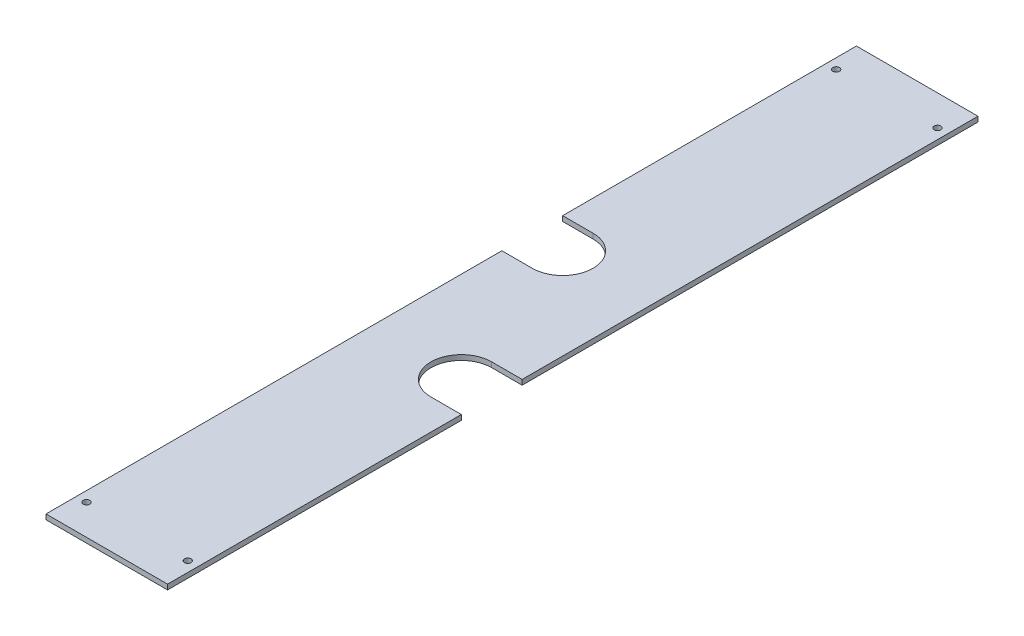
ISO-10303-21;
HEADER;
FILE_DESCRIPTION(('STEP AP214'),'2;1');
FILE_NAME('part.step','',(''),(''),'','','');
FILE_SCHEMA(('AUTOMOTIVE_DESIGN { 1 0 10303 214 1 1 1 1 }'));
ENDSEC;
DATA;
#1=APPLICATION_CONTEXT('core data for automotive mechanical design processes');
#2=APPLICATION_PROTOCOL_DEFINITION('international standard','automotive_design',2000,#1);
#3=PRODUCT_CONTEXT('',#1,'mechanical');
#4=PRODUCT('Part','Part','',(#3));
#5=PRODUCT_RELATED_PRODUCT_CATEGORY('part','',(#4));
#6=PRODUCT_DEFINITION_FORMATION('','',#4);
#7=PRODUCT_DEFINITION_CONTEXT('part definition',#1,'design');
#8=PRODUCT_DEFINITION('design','',#6,#7);
#9=PRODUCT_DEFINITION_SHAPE('','',#8);
#10=(LENGTH_UNIT() NAMED_UNIT(*) SI_UNIT(.MILLI.,.METRE.));
#11=(NAMED_UNIT(*) PLANE_ANGLE_UNIT() SI_UNIT($,.RADIAN.));
#12=(NAMED_UNIT(*) SI_UNIT($,.STERADIAN.) SOLID_ANGLE_UNIT());
#13=UNCERTAINTY_MEASURE_WITH_UNIT(LENGTH_MEASURE(1.E-05),#10,'distance_accuracy_value','');
#14=(GEOMETRIC_REPRESENTATION_CONTEXT(3) GLOBAL_UNCERTAINTY_ASSIGNED_CONTEXT((#13)) GLOBAL_UNIT_ASSIGNED_CONTEXT((#10,
#11,#12)) REPRESENTATION_CONTEXT('',''));
#15=CARTESIAN_POINT('',(0.,0.,0.));
#16=DIRECTION('',(0.,0.,1.));
#17=DIRECTION('',(1.,0.,0.));
#18=AXIS2_PLACEMENT_3D('',#15,#16,#17);
#19=CARTESIAN_POINT('',(-38.1,22.8952505991963,508.));
#20=DIRECTION('',(1.,0.,0.));
#21=DIRECTION('',(0.,0.,-1.));
#22=AXIS2_PLACEMENT_3D('',#19,#20,#21);
#23=PLANE('',#22);
#24=DIRECTION('',(0.,0.,-1.));
#25=VECTOR('',#24,1.);
#26=CARTESIAN_POINT('',(-38.1,22.8952505991963,508.));
#27=LINE('',#26,#25);
#28=CARTESIAN_POINT('',(-38.1,22.8952505991963,508.));
#29=VERTEX_POINT('',#28);
#30=CARTESIAN_POINT('',(-38.1,22.8952505991963,222.25));
#31=VERTEX_POINT('',#30);
#32=EDGE_CURVE('E210',#29,#31,#27,.T.);
#33=ORIENTED_EDGE('',*,*,#32,.T.);
#34=DIRECTION('',(0.,1.,0.));
#35=VECTOR('',#34,1.);
#36=CARTESIAN_POINT('',(-38.1,19.7202505991963,222.25));
#37=LINE('',#36,#35);
#38=CARTESIAN_POINT('',(-38.1,19.7202505991963,222.25));
#39=VERTEX_POINT('',#38);
#40=EDGE_CURVE('E159',#39,#31,#37,.T.);
#41=ORIENTED_EDGE('',*,*,#40,.F.);
#42=DIRECTION('',(0.,0.,-1.));
#43=VECTOR('',#42,1.);
#44=CARTESIAN_POINT('',(-38.1,19.7202505991963,508.));
#45=LINE('',#44,#43);
#46=CARTESIAN_POINT('',(-38.1,19.7202505991963,508.));
#47=VERTEX_POINT('',#46);
#48=EDGE_CURVE('E11',#47,#39,#45,.T.);
#49=ORIENTED_EDGE('',*,*,#48,.F.);
#50=DIRECTION('',(0.,-1.,0.));
#51=VECTOR('',#50,1.);
#52=CARTESIAN_POINT('',(-38.1,22.8952505991963,508.));
#53=LINE('',#52,#51);
#54=EDGE_CURVE('E187',#29,#47,#53,.T.);
#55=ORIENTED_EDGE('',*,*,#54,.F.);
#56=EDGE_LOOP('',(#33,#41,#49,#55));
#57=FACE_BOUND('',#56,.T.);
#58=ADVANCED_FACE('F38',(#57),#23,.F.);
#59=CARTESIAN_POINT('',(38.1,22.8952505991963,508.));
#60=DIRECTION('',(1.,0.,0.));
#61=DIRECTION('',(0.,0.,-1.));
#62=AXIS2_PLACEMENT_3D('',#59,#60,#61);
#63=PLANE('',#62);
#64=DIRECTION('',(0.,1.,0.));
#65=VECTOR('',#64,1.);
#66=CARTESIAN_POINT('',(38.1,19.7202505991963,285.75));
#67=LINE('',#66,#65);
#68=CARTESIAN_POINT('',(38.1,19.7202505991963,285.75));
#69=VERTEX_POINT('',#68);
#70=CARTESIAN_POINT('',(38.1,22.8952505991963,285.75));
#71=VERTEX_POINT('',#70);
#72=EDGE_CURVE('E168',#69,#71,#67,.T.);
#73=ORIENTED_EDGE('',*,*,#72,.F.);
#74=DIRECTION('',(0.,0.,-1.));
#75=VECTOR('',#74,1.);
#76=CARTESIAN_POINT('',(38.1,19.7202505991963,508.));
#77=LINE('',#76,#75);
#78=CARTESIAN_POINT('',(38.1,19.7202505991963,0.));
#79=VERTEX_POINT('',#78);
#80=EDGE_CURVE('E216',#69,#79,#77,.T.);
#81=ORIENTED_EDGE('',*,*,#80,.T.);
#82=DIRECTION('',(0.,-1.,0.));
#83=VECTOR('',#82,1.);
#84=CARTESIAN_POINT('',(38.1,22.8952505991963,0.));
#85=LINE('',#84,#83);
#86=CARTESIAN_POINT('',(38.1,22.8952505991963,0.));
#87=VERTEX_POINT('',#86);
#88=EDGE_CURVE('E205',#87,#79,#85,.T.);
#89=ORIENTED_EDGE('',*,*,#88,.F.);
#90=DIRECTION('',(0.,0.,-1.));
#91=VECTOR('',#90,1.);
#92=CARTESIAN_POINT('',(38.1,22.8952505991963,508.));
#93=LINE('',#92,#91);
#94=EDGE_CURVE('E213',#71,#87,#93,.T.);
#95=ORIENTED_EDGE('',*,*,#94,.F.);
#96=EDGE_LOOP('',(#73,#81,#89,#95));
#97=FACE_BOUND('',#96,.T.);
#98=ADVANCED_FACE('F225',(#97),#63,.T.);
#99=CARTESIAN_POINT('',(-38.1,19.7202505991963,184.15));
#100=VERTEX_POINT('',#99);
#101=CARTESIAN_POINT('',(-38.1,19.7202505991963,0.));
#102=VERTEX_POINT('',#101);
#103=EDGE_CURVE('E46',#100,#102,#45,.T.);
#104=ORIENTED_EDGE('',*,*,#103,.F.);
#105=DIRECTION('',(0.,1.,0.));
#106=VECTOR('',#105,1.);
#107=CARTESIAN_POINT('',(-38.1,19.7202505991963,184.15));
#108=LINE('',#107,#106);
#109=CARTESIAN_POINT('',(-38.1,22.8952505991963,184.15));
#110=VERTEX_POINT('',#109);
#111=EDGE_CURVE('E133',#100,#110,#108,.T.);
#112=ORIENTED_EDGE('',*,*,#111,.T.);
#113=CARTESIAN_POINT('',(-38.1,22.8952505991963,0.));
#114=VERTEX_POINT('',#113);
#115=EDGE_CURVE('E199',#110,#114,#27,.T.);
#116=ORIENTED_EDGE('',*,*,#115,.T.);
#117=DIRECTION('',(0.,-1.,0.));
#118=VECTOR('',#117,1.);
#119=CARTESIAN_POINT('',(-38.1,22.8952505991963,0.));
#120=LINE('',#119,#118);
#121=EDGE_CURVE('E158',#114,#102,#120,.T.);
#122=ORIENTED_EDGE('',*,*,#121,.T.);
#123=EDGE_LOOP('',(#104,#112,#116,#122));
#124=FACE_BOUND('',#123,.T.);
#125=ADVANCED_FACE('F40',(#124),#23,.F.);
#126=CARTESIAN_POINT('',(-38.1,19.7202505991963,508.));
#127=DIRECTION('',(0.,1.,0.));
#128=DIRECTION('',(0.,0.,1.));
#129=AXIS2_PLACEMENT_3D('',#126,#127,#128);
#130=PLANE('',#129);
#131=CARTESIAN_POINT('',(-31.75,19.7202505991963,19.05));
#132=DIRECTION('',(0.,-1.,0.));
#133=DIRECTION('',(0.,0.,-1.));
#134=AXIS2_PLACEMENT_3D('',#131,#132,#133);
#135=CIRCLE('',#134,2.08280000000001);
#136=CARTESIAN_POINT('',(-31.75,19.7202505991963,16.9672));
#137=VERTEX_POINT('',#136);
#138=EDGE_CURVE('E446',#137,#137,#135,.T.);
#139=ORIENTED_EDGE('',*,*,#138,.F.);
#140=EDGE_LOOP('',(#139));
#141=FACE_BOUND('',#140,.T.);
#142=CARTESIAN_POINT('',(31.75,19.7202505991963,488.95));
#143=DIRECTION('',(0.,-1.,0.));
#144=DIRECTION('',(0.,0.,-1.));
#145=AXIS2_PLACEMENT_3D('',#142,#143,#144);
#146=CIRCLE('',#145,2.0828);
#147=CARTESIAN_POINT('',(31.75,19.7202505991963,486.8672));
#148=VERTEX_POINT('',#147);
#149=EDGE_CURVE('E450',#148,#148,#146,.T.);
#150=ORIENTED_EDGE('',*,*,#149,.F.);
#151=EDGE_LOOP('',(#150));
#152=FACE_BOUND('',#151,.T.);
#153=CARTESIAN_POINT('',(-31.75,19.7202505991963,488.95));
#154=DIRECTION('',(0.,1.,0.));
#155=DIRECTION('',(0.,0.,1.));
#156=AXIS2_PLACEMENT_3D('',#153,#154,#155);
#157=CIRCLE('',#156,2.08280000000001);
#158=CARTESIAN_POINT('',(-31.75,19.7202505991963,491.0328));
#159=VERTEX_POINT('',#158);
#160=EDGE_CURVE('E172',#159,#159,#157,.T.);
#161=ORIENTED_EDGE('',*,*,#160,.T.);
#162=EDGE_LOOP('',(#161));
#163=FACE_BOUND('',#162,.T.);
#164=CARTESIAN_POINT('',(31.75,19.7202505991963,19.05));
#165=DIRECTION('',(0.,1.,0.));
#166=DIRECTION('',(0.,0.,1.));
#167=AXIS2_PLACEMENT_3D('',#164,#165,#166);
#168=CIRCLE('',#167,2.0828);
#169=CARTESIAN_POINT('',(31.75,19.7202505991963,21.1328));
#170=VERTEX_POINT('',#169);
#171=EDGE_CURVE('E150',#170,#170,#168,.T.);
#172=ORIENTED_EDGE('',*,*,#171,.T.);
#173=EDGE_LOOP('',(#172));
#174=FACE_BOUND('',#173,.T.);
#175=ORIENTED_EDGE('',*,*,#48,.T.);
#176=DIRECTION('',(1.,0.,0.));
#177=VECTOR('',#176,1.);
#178=CARTESIAN_POINT('',(-38.1,19.7202505991963,222.25));
#179=LINE('',#178,#177);
#180=CARTESIAN_POINT('',(-19.05,19.7202505991963,222.25));
#181=VERTEX_POINT('',#180);
#182=EDGE_CURVE('E134',#39,#181,#179,.T.);
#183=ORIENTED_EDGE('',*,*,#182,.T.);
#184=CARTESIAN_POINT('',(-19.05,19.7202505991963,203.2));
#185=DIRECTION('',(0.,1.,0.));
#186=DIRECTION('',(0.,0.,1.));
#187=AXIS2_PLACEMENT_3D('',#184,#185,#186);
#188=CIRCLE('',#187,19.05);
#189=CARTESIAN_POINT('',(-19.05,19.7202505991963,184.15));
#190=VERTEX_POINT('',#189);
#191=EDGE_CURVE('E129',#181,#190,#188,.T.);
#192=ORIENTED_EDGE('',*,*,#191,.T.);
#193=DIRECTION('',(-1.,0.,0.));
#194=VECTOR('',#193,1.);
#195=CARTESIAN_POINT('',(-19.05,19.7202505991963,184.15));
#196=LINE('',#195,#194);
#197=EDGE_CURVE('E137',#190,#100,#196,.T.);
#198=ORIENTED_EDGE('',*,*,#197,.T.);
#199=ORIENTED_EDGE('',*,*,#103,.T.);
#200=DIRECTION('',(1.,0.,0.));
#201=VECTOR('',#200,1.);
#202=CARTESIAN_POINT('',(-38.1,19.7202505991963,0.));
#203=LINE('',#202,#201);
#204=EDGE_CURVE('E202',#102,#79,#203,.T.);
#205=ORIENTED_EDGE('',*,*,#204,.T.);
#206=ORIENTED_EDGE('',*,*,#80,.F.);
#207=DIRECTION('',(-1.,0.,0.));
#208=VECTOR('',#207,1.);
#209=CARTESIAN_POINT('',(38.1,19.7202505991963,285.75));
#210=LINE('',#209,#208);
#211=CARTESIAN_POINT('',(19.05,19.7202505991963,285.75));
#212=VERTEX_POINT('',#211);
#213=EDGE_CURVE('E164',#69,#212,#210,.T.);
#214=ORIENTED_EDGE('',*,*,#213,.T.);
#215=CARTESIAN_POINT('',(19.05,19.7202505991963,304.8));
#216=DIRECTION('',(0.,1.,0.));
#217=DIRECTION('',(0.,0.,1.));
#218=AXIS2_PLACEMENT_3D('',#215,#216,#217);
#219=CIRCLE('',#218,19.05);
#220=CARTESIAN_POINT('',(19.05,19.7202505991963,323.85));
#221=VERTEX_POINT('',#220);
#222=EDGE_CURVE('E177',#212,#221,#219,.T.);
#223=ORIENTED_EDGE('',*,*,#222,.T.);
#224=DIRECTION('',(1.,0.,0.));
#225=VECTOR('',#224,1.);
#226=CARTESIAN_POINT('',(19.05,19.7202505991963,323.85));
#227=LINE('',#226,#225);
#228=CARTESIAN_POINT('',(38.1,19.7202505991963,323.85));
#229=VERTEX_POINT('',#228);
#230=EDGE_CURVE('E182',#221,#229,#227,.T.);
#231=ORIENTED_EDGE('',*,*,#230,.T.);
#232=CARTESIAN_POINT('',(38.1,19.7202505991963,508.));
#233=VERTEX_POINT('',#232);
#234=EDGE_CURVE('E217',#233,#229,#77,.T.);
#235=ORIENTED_EDGE('',*,*,#234,.F.);
#236=DIRECTION('',(1.,0.,0.));
#237=VECTOR('',#236,1.);
#238=CARTESIAN_POINT('',(-38.1,19.7202505991963,508.));
#239=LINE('',#238,#237);
#240=EDGE_CURVE('E190',#47,#233,#239,.T.);
#241=ORIENTED_EDGE('',*,*,#240,.F.);
#242=EDGE_LOOP('',(#175,#183,#192,#198,#199,#205,#206,#214,#223,#231,#235,#241));
#243=FACE_BOUND('',#242,.T.);
#244=ADVANCED_FACE('F143',(#141,#152,#163,#174,#243),#130,.F.);
#245=DIRECTION('',(0.,1.,0.));
#246=VECTOR('',#245,1.);
#247=CARTESIAN_POINT('',(38.1,19.7202505991963,323.85));
#248=LINE('',#247,#246);
#249=CARTESIAN_POINT('',(38.1,22.8952505991963,323.85));
#250=VERTEX_POINT('',#249);
#251=EDGE_CURVE('E165',#229,#250,#248,.T.);
#252=ORIENTED_EDGE('',*,*,#251,.T.);
#253=CARTESIAN_POINT('',(38.1,22.8952505991963,508.));
#254=VERTEX_POINT('',#253);
#255=EDGE_CURVE('E214',#254,#250,#93,.T.);
#256=ORIENTED_EDGE('',*,*,#255,.F.);
#257=DIRECTION('',(0.,-1.,0.));
#258=VECTOR('',#257,1.);
#259=CARTESIAN_POINT('',(38.1,22.8952505991963,508.));
#260=LINE('',#259,#258);
#261=EDGE_CURVE('E193',#254,#233,#260,.T.);
#262=ORIENTED_EDGE('',*,*,#261,.T.);
#263=ORIENTED_EDGE('',*,*,#234,.T.);
#264=EDGE_LOOP('',(#252,#256,#262,#263));
#265=FACE_BOUND('',#264,.T.);
#266=ADVANCED_FACE('F245',(#265),#63,.T.);
#267=CARTESIAN_POINT('',(-38.1,22.8952505991963,508.));
#268=DIRECTION('',(0.,1.,0.));
#269=DIRECTION('',(0.,0.,1.));
#270=AXIS2_PLACEMENT_3D('',#267,#268,#269);
#271=PLANE('',#270);
#272=CARTESIAN_POINT('',(-31.75,22.8952505991963,19.05));
#273=DIRECTION('',(0.,-1.,0.));
#274=DIRECTION('',(0.,0.,-1.));
#275=AXIS2_PLACEMENT_3D('',#272,#273,#274);
#276=CIRCLE('',#275,2.08280000000001);
#277=CARTESIAN_POINT('',(-31.75,22.8952505991963,16.9672));
#278=VERTEX_POINT('',#277);
#279=EDGE_CURVE('E449',#278,#278,#276,.T.);
#280=ORIENTED_EDGE('',*,*,#279,.T.);
#281=EDGE_LOOP('',(#280));
#282=FACE_BOUND('',#281,.T.);
#283=CARTESIAN_POINT('',(31.75,22.8952505991963,488.95));
#284=DIRECTION('',(0.,-1.,0.));
#285=DIRECTION('',(0.,0.,-1.));
#286=AXIS2_PLACEMENT_3D('',#283,#284,#285);
#287=CIRCLE('',#286,2.0828);
#288=CARTESIAN_POINT('',(31.75,22.8952505991963,486.8672));
#289=VERTEX_POINT('',#288);
#290=EDGE_CURVE('E454',#289,#289,#287,.T.);
#291=ORIENTED_EDGE('',*,*,#290,.T.);
#292=EDGE_LOOP('',(#291));
#293=FACE_BOUND('',#292,.T.);
#294=CARTESIAN_POINT('',(-31.75,22.8952505991963,488.95));
#295=DIRECTION('',(0.,1.,0.));
#296=DIRECTION('',(0.,0.,1.));
#297=AXIS2_PLACEMENT_3D('',#294,#295,#296);
#298=CIRCLE('',#297,2.08280000000001);
#299=CARTESIAN_POINT('',(-31.75,22.8952505991963,491.0328));
#300=VERTEX_POINT('',#299);
#301=EDGE_CURVE('E461',#300,#300,#298,.T.);
#302=ORIENTED_EDGE('',*,*,#301,.F.);
#303=EDGE_LOOP('',(#302));
#304=FACE_BOUND('',#303,.T.);
#305=CARTESIAN_POINT('',(31.75,22.8952505991963,19.05));
#306=DIRECTION('',(0.,1.,0.));
#307=DIRECTION('',(0.,0.,1.));
#308=AXIS2_PLACEMENT_3D('',#305,#306,#307);
#309=CIRCLE('',#308,2.0828);
#310=CARTESIAN_POINT('',(31.75,22.8952505991963,21.1328));
#311=VERTEX_POINT('',#310);
#312=EDGE_CURVE('E463',#311,#311,#309,.T.);
#313=ORIENTED_EDGE('',*,*,#312,.F.);
#314=EDGE_LOOP('',(#313));
#315=FACE_BOUND('',#314,.T.);
#316=DIRECTION('',(1.,0.,0.));
#317=VECTOR('',#316,1.);
#318=CARTESIAN_POINT('',(-38.1,22.8952505991963,222.25));
#319=LINE('',#318,#317);
#320=CARTESIAN_POINT('',(-19.05,22.8952505991963,222.25));
#321=VERTEX_POINT('',#320);
#322=EDGE_CURVE('E144',#31,#321,#319,.T.);
#323=ORIENTED_EDGE('',*,*,#322,.F.);
#324=ORIENTED_EDGE('',*,*,#32,.F.);
#325=DIRECTION('',(1.,0.,0.));
#326=VECTOR('',#325,1.);
#327=CARTESIAN_POINT('',(-38.1,22.8952505991963,508.));
#328=LINE('',#327,#326);
#329=EDGE_CURVE('E196',#29,#254,#328,.T.);
#330=ORIENTED_EDGE('',*,*,#329,.T.);
#331=ORIENTED_EDGE('',*,*,#255,.T.);
#332=DIRECTION('',(1.,0.,0.));
#333=VECTOR('',#332,1.);
#334=CARTESIAN_POINT('',(19.05,22.8952505991963,323.85));
#335=LINE('',#334,#333);
#336=CARTESIAN_POINT('',(19.05,22.8952505991963,323.85));
#337=VERTEX_POINT('',#336);
#338=EDGE_CURVE('E176',#337,#250,#335,.T.);
#339=ORIENTED_EDGE('',*,*,#338,.F.);
#340=CARTESIAN_POINT('',(19.05,22.8952505991963,304.8));
#341=DIRECTION('',(0.,1.,0.));
#342=DIRECTION('',(0.,0.,1.));
#343=AXIS2_PLACEMENT_3D('',#340,#341,#342);
#344=CIRCLE('',#343,19.05);
#345=CARTESIAN_POINT('',(19.05,22.8952505991963,285.75));
#346=VERTEX_POINT('',#345);
#347=EDGE_CURVE('E61',#346,#337,#344,.T.);
#348=ORIENTED_EDGE('',*,*,#347,.F.);
#349=DIRECTION('',(-1.,0.,0.));
#350=VECTOR('',#349,1.);
#351=CARTESIAN_POINT('',(38.1,22.8952505991963,285.75));
#352=LINE('',#351,#350);
#353=EDGE_CURVE('E173',#71,#346,#352,.T.);
#354=ORIENTED_EDGE('',*,*,#353,.F.);
#355=ORIENTED_EDGE('',*,*,#94,.T.);
#356=DIRECTION('',(1.,0.,0.));
#357=VECTOR('',#356,1.);
#358=CARTESIAN_POINT('',(-38.1,22.8952505991963,0.));
#359=LINE('',#358,#357);
#360=EDGE_CURVE('E191',#114,#87,#359,.T.);
#361=ORIENTED_EDGE('',*,*,#360,.F.);
#362=ORIENTED_EDGE('',*,*,#115,.F.);
#363=DIRECTION('',(-1.,0.,0.));
#364=VECTOR('',#363,1.);
#365=CARTESIAN_POINT('',(-19.05,22.8952505991963,184.15));
#366=LINE('',#365,#364);
#367=CARTESIAN_POINT('',(-19.05,22.8952505991963,184.15));
#368=VERTEX_POINT('',#367);
#369=EDGE_CURVE('E147',#368,#110,#366,.T.);
#370=ORIENTED_EDGE('',*,*,#369,.F.);
#371=CARTESIAN_POINT('',(-19.05,22.8952505991963,203.2));
#372=DIRECTION('',(0.,1.,0.));
#373=DIRECTION('',(0.,0.,1.));
#374=AXIS2_PLACEMENT_3D('',#371,#372,#373);
#375=CIRCLE('',#374,19.05);
#376=EDGE_CURVE('E53',#321,#368,#375,.T.);
#377=ORIENTED_EDGE('',*,*,#376,.F.);
#378=EDGE_LOOP('',(#323,#324,#330,#331,#339,#348,#354,#355,#361,#362,#370,#377));
#379=FACE_BOUND('',#378,.T.);
#380=ADVANCED_FACE('F235',(#282,#293,#304,#315,#379),#271,.T.);
#381=CARTESIAN_POINT('',(0.,0.,508.));
#382=DIRECTION('',(0.,0.,1.));
#383=DIRECTION('',(1.,0.,0.));
#384=AXIS2_PLACEMENT_3D('',#381,#382,#383);
#385=PLANE('',#384);
#386=ORIENTED_EDGE('',*,*,#54,.T.);
#387=ORIENTED_EDGE('',*,*,#240,.T.);
#388=ORIENTED_EDGE('',*,*,#261,.F.);
#389=ORIENTED_EDGE('',*,*,#329,.F.);
#390=EDGE_LOOP('',(#386,#387,#388,#389));
#391=FACE_BOUND('',#390,.T.);
#392=ADVANCED_FACE('F250',(#391),#385,.T.);
#393=CARTESIAN_POINT('',(0.,0.,0.));
#394=DIRECTION('',(0.,0.,1.));
#395=DIRECTION('',(1.,0.,0.));
#396=AXIS2_PLACEMENT_3D('',#393,#394,#395);
#397=PLANE('',#396);
#398=ORIENTED_EDGE('',*,*,#121,.F.);
#399=ORIENTED_EDGE('',*,*,#360,.T.);
#400=ORIENTED_EDGE('',*,*,#88,.T.);
#401=ORIENTED_EDGE('',*,*,#204,.F.);
#402=EDGE_LOOP('',(#398,#399,#400,#401));
#403=FACE_BOUND('',#402,.T.);
#404=ADVANCED_FACE('F230',(#403),#397,.F.);
#405=CARTESIAN_POINT('',(19.05,19.7202505991963,304.8));
#406=DIRECTION('',(0.,1.,0.));
#407=DIRECTION('',(0.,0.,1.));
#408=AXIS2_PLACEMENT_3D('',#405,#406,#407);
#409=CYLINDRICAL_SURFACE('',#408,19.05);
#410=ORIENTED_EDGE('',*,*,#347,.T.);
#411=DIRECTION('',(0.,1.,0.));
#412=VECTOR('',#411,1.);
#413=CARTESIAN_POINT('',(19.05,19.7202505991963,323.85));
#414=LINE('',#413,#412);
#415=EDGE_CURVE('E162',#221,#337,#414,.T.);
#416=ORIENTED_EDGE('',*,*,#415,.F.);
#417=ORIENTED_EDGE('',*,*,#222,.F.);
#418=DIRECTION('',(0.,1.,0.));
#419=VECTOR('',#418,1.);
#420=CARTESIAN_POINT('',(19.05,19.7202505991963,285.75));
#421=LINE('',#420,#419);
#422=EDGE_CURVE('E170',#212,#346,#421,.T.);
#423=ORIENTED_EDGE('',*,*,#422,.T.);
#424=EDGE_LOOP('',(#410,#416,#417,#423));
#425=FACE_BOUND('',#424,.T.);
#426=ADVANCED_FACE('F242',(#425),#409,.F.);
#427=CARTESIAN_POINT('',(38.1,19.7202505991963,285.75));
#428=DIRECTION('',(0.,0.,-1.));
#429=DIRECTION('',(-1.,0.,0.));
#430=AXIS2_PLACEMENT_3D('',#427,#428,#429);
#431=PLANE('',#430);
#432=ORIENTED_EDGE('',*,*,#353,.T.);
#433=ORIENTED_EDGE('',*,*,#422,.F.);
#434=ORIENTED_EDGE('',*,*,#213,.F.);
#435=ORIENTED_EDGE('',*,*,#72,.T.);
#436=EDGE_LOOP('',(#432,#433,#434,#435));
#437=FACE_BOUND('',#436,.T.);
#438=ADVANCED_FACE('F239',(#437),#431,.F.);
#439=CARTESIAN_POINT('',(19.05,19.7202505991963,323.85));
#440=DIRECTION('',(0.,0.,1.));
#441=DIRECTION('',(1.,0.,0.));
#442=AXIS2_PLACEMENT_3D('',#439,#440,#441);
#443=PLANE('',#442);
#444=ORIENTED_EDGE('',*,*,#338,.T.);
#445=ORIENTED_EDGE('',*,*,#251,.F.);
#446=ORIENTED_EDGE('',*,*,#230,.F.);
#447=ORIENTED_EDGE('',*,*,#415,.T.);
#448=EDGE_LOOP('',(#444,#445,#446,#447));
#449=FACE_BOUND('',#448,.T.);
#450=ADVANCED_FACE('F244',(#449),#443,.F.);
#451=CARTESIAN_POINT('',(-19.05,19.7202505991963,203.2));
#452=DIRECTION('',(0.,1.,0.));
#453=DIRECTION('',(0.,0.,1.));
#454=AXIS2_PLACEMENT_3D('',#451,#452,#453);
#455=CYLINDRICAL_SURFACE('',#454,19.05);
#456=ORIENTED_EDGE('',*,*,#376,.T.);
#457=DIRECTION('',(0.,1.,0.));
#458=VECTOR('',#457,1.);
#459=CARTESIAN_POINT('',(-19.05,19.7202505991963,184.15));
#460=LINE('',#459,#458);
#461=EDGE_CURVE('E125',#190,#368,#460,.T.);
#462=ORIENTED_EDGE('',*,*,#461,.F.);
#463=ORIENTED_EDGE('',*,*,#191,.F.);
#464=DIRECTION('',(0.,1.,0.));
#465=VECTOR('',#464,1.);
#466=CARTESIAN_POINT('',(-19.05,19.7202505991963,222.25));
#467=LINE('',#466,#465);
#468=EDGE_CURVE('E156',#181,#321,#467,.T.);
#469=ORIENTED_EDGE('',*,*,#468,.T.);
#470=EDGE_LOOP('',(#456,#462,#463,#469));
#471=FACE_BOUND('',#470,.T.);
#472=ADVANCED_FACE('F127',(#471),#455,.F.);
#473=CARTESIAN_POINT('',(-38.1,19.7202505991963,222.25));
#474=DIRECTION('',(0.,0.,1.));
#475=DIRECTION('',(1.,0.,0.));
#476=AXIS2_PLACEMENT_3D('',#473,#474,#475);
#477=PLANE('',#476);
#478=ORIENTED_EDGE('',*,*,#322,.T.);
#479=ORIENTED_EDGE('',*,*,#468,.F.);
#480=ORIENTED_EDGE('',*,*,#182,.F.);
#481=ORIENTED_EDGE('',*,*,#40,.T.);
#482=EDGE_LOOP('',(#478,#479,#480,#481));
#483=FACE_BOUND('',#482,.T.);
#484=ADVANCED_FACE('F255',(#483),#477,.F.);
#485=CARTESIAN_POINT('',(-19.05,19.7202505991963,184.15));
#486=DIRECTION('',(0.,0.,-1.));
#487=DIRECTION('',(-1.,0.,0.));
#488=AXIS2_PLACEMENT_3D('',#485,#486,#487);
#489=PLANE('',#488);
#490=ORIENTED_EDGE('',*,*,#369,.T.);
#491=ORIENTED_EDGE('',*,*,#111,.F.);
#492=ORIENTED_EDGE('',*,*,#197,.F.);
#493=ORIENTED_EDGE('',*,*,#461,.T.);
#494=EDGE_LOOP('',(#490,#491,#492,#493));
#495=FACE_BOUND('',#494,.T.);
#496=ADVANCED_FACE('F138',(#495),#489,.F.);
#497=CARTESIAN_POINT('',(31.75,19.7202505991963,19.05));
#498=DIRECTION('',(0.,1.,0.));
#499=DIRECTION('',(0.,0.,1.));
#500=AXIS2_PLACEMENT_3D('',#497,#498,#499);
#501=CYLINDRICAL_SURFACE('',#500,2.0828);
#502=ORIENTED_EDGE('',*,*,#171,.F.);
#503=EDGE_LOOP('',(#502));
#504=FACE_BOUND('',#503,.T.);
#505=ORIENTED_EDGE('',*,*,#312,.T.);
#506=EDGE_LOOP('',(#505));
#507=FACE_BOUND('',#506,.T.);
#508=ADVANCED_FACE('F346',(#504,#507),#501,.F.);
#509=CARTESIAN_POINT('',(-31.75,19.7202505991963,488.95));
#510=DIRECTION('',(0.,1.,0.));
#511=DIRECTION('',(0.,0.,1.));
#512=AXIS2_PLACEMENT_3D('',#509,#510,#511);
#513=CYLINDRICAL_SURFACE('',#512,2.08280000000001);
#514=ORIENTED_EDGE('',*,*,#160,.F.);
#515=EDGE_LOOP('',(#514));
#516=FACE_BOUND('',#515,.T.);
#517=ORIENTED_EDGE('',*,*,#301,.T.);
#518=EDGE_LOOP('',(#517));
#519=FACE_BOUND('',#518,.T.);
#520=ADVANCED_FACE('F356',(#516,#519),#513,.F.);
#521=CARTESIAN_POINT('',(31.75,19.7202505991963,488.95));
#522=DIRECTION('',(0.,1.,0.));
#523=DIRECTION('',(0.,0.,1.));
#524=AXIS2_PLACEMENT_3D('',#521,#522,#523);
#525=CYLINDRICAL_SURFACE('',#524,2.0828);
#526=ORIENTED_EDGE('',*,*,#149,.T.);
#527=EDGE_LOOP('',(#526));
#528=FACE_BOUND('',#527,.T.);
#529=ORIENTED_EDGE('',*,*,#290,.F.);
#530=EDGE_LOOP('',(#529));
#531=FACE_BOUND('',#530,.T.);
#532=ADVANCED_FACE('F366',(#528,#531),#525,.F.);
#533=CARTESIAN_POINT('',(-31.75,19.7202505991963,19.05));
#534=DIRECTION('',(0.,1.,0.));
#535=DIRECTION('',(0.,0.,1.));
#536=AXIS2_PLACEMENT_3D('',#533,#534,#535);
#537=CYLINDRICAL_SURFACE('',#536,2.08280000000001);
#538=ORIENTED_EDGE('',*,*,#138,.T.);
#539=EDGE_LOOP('',(#538));
#540=FACE_BOUND('',#539,.T.);
#541=ORIENTED_EDGE('',*,*,#279,.F.);
#542=EDGE_LOOP('',(#541));
#543=FACE_BOUND('',#542,.T.);
#544=ADVANCED_FACE('F386',(#540,#543),#537,.F.);
#545=CLOSED_SHELL('',(#58,#98,#125,#244,#266,#380,#392,#404,#426,#438,#450,#472,#484,#496,#508,
#520,#532,#544));
#546=MANIFOLD_SOLID_BREP('B2',#545);
#547=ADVANCED_BREP_SHAPE_REPRESENTATION('',(#18,#546),#14);
#548=SHAPE_DEFINITION_REPRESENTATION(#9,#547);
ENDSEC;
END-ISO-10303-21;
